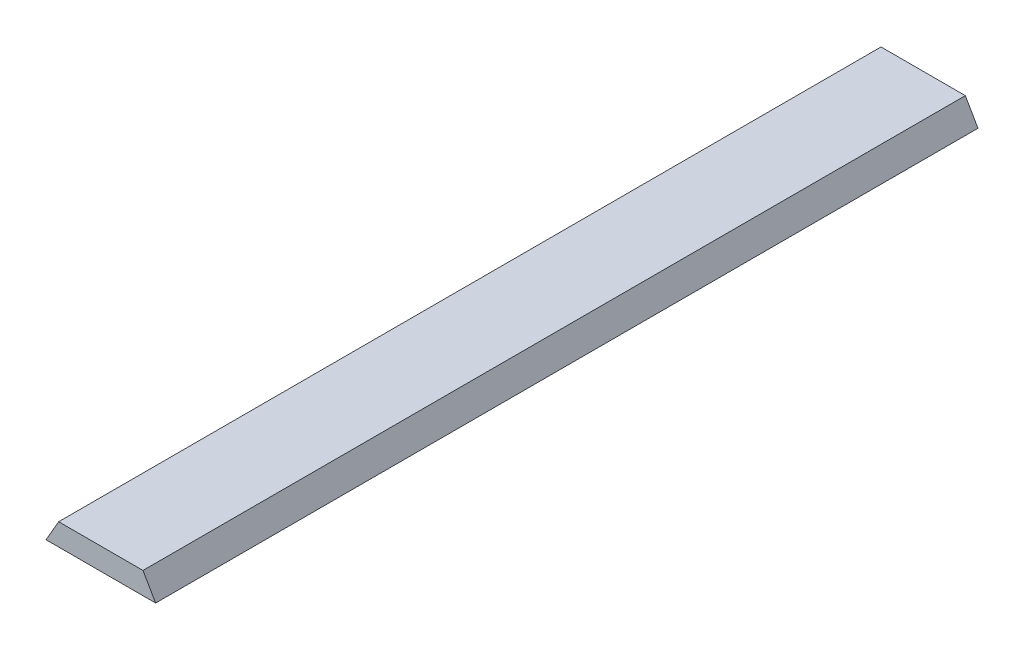
ISO-10303-21;
HEADER;
FILE_DESCRIPTION(('STEP AP214'),'2;1');
FILE_NAME('part.step','',(''),(''),'','','');
FILE_SCHEMA(('AUTOMOTIVE_DESIGN { 1 0 10303 214 1 1 1 1 }'));
ENDSEC;
DATA;
#1=APPLICATION_CONTEXT('core data for automotive mechanical design processes');
#2=APPLICATION_PROTOCOL_DEFINITION('international standard','automotive_design',2000,#1);
#3=PRODUCT_CONTEXT('',#1,'mechanical');
#4=PRODUCT('Part','Part','',(#3));
#5=PRODUCT_RELATED_PRODUCT_CATEGORY('part','',(#4));
#6=PRODUCT_DEFINITION_FORMATION('','',#4);
#7=PRODUCT_DEFINITION_CONTEXT('part definition',#1,'design');
#8=PRODUCT_DEFINITION('design','',#6,#7);
#9=PRODUCT_DEFINITION_SHAPE('','',#8);
#10=(LENGTH_UNIT() NAMED_UNIT(*) SI_UNIT(.MILLI.,.METRE.));
#11=(NAMED_UNIT(*) PLANE_ANGLE_UNIT() SI_UNIT($,.RADIAN.));
#12=(NAMED_UNIT(*) SI_UNIT($,.STERADIAN.) SOLID_ANGLE_UNIT());
#13=UNCERTAINTY_MEASURE_WITH_UNIT(LENGTH_MEASURE(1.E-05),#10,'distance_accuracy_value','');
#14=(GEOMETRIC_REPRESENTATION_CONTEXT(3) GLOBAL_UNCERTAINTY_ASSIGNED_CONTEXT((#13)) GLOBAL_UNIT_ASSIGNED_CONTEXT((#10,
#11,#12)) REPRESENTATION_CONTEXT('',''));
#15=CARTESIAN_POINT('',(0.,0.,0.));
#16=DIRECTION('',(0.,0.,1.));
#17=DIRECTION('',(1.,0.,0.));
#18=AXIS2_PLACEMENT_3D('',#15,#16,#17);
#19=CARTESIAN_POINT('',(-1.,0.2,15.));
#20=DIRECTION('',(0.,-1.,0.));
#21=DIRECTION('',(0.,0.,-1.));
#22=AXIS2_PLACEMENT_3D('',#19,#20,#21);
#23=PLANE('',#22);
#24=DIRECTION('',(-1.,0.,0.));
#25=VECTOR('',#24,1.);
#26=CARTESIAN_POINT('',(-1.,0.2,0.));
#27=LINE('',#26,#25);
#28=CARTESIAN_POINT('',(0.769059892324149,0.2,0.));
#29=VERTEX_POINT('',#28);
#30=CARTESIAN_POINT('',(-0.76905989232415,0.2,0.));
#31=VERTEX_POINT('',#30);
#32=EDGE_CURVE('E104',#29,#31,#27,.T.);
#33=ORIENTED_EDGE('',*,*,#32,.T.);
#34=DIRECTION('',(0.,0.,1.));
#35=VECTOR('',#34,1.);
#36=CARTESIAN_POINT('',(-0.76905989232415,0.2,15.));
#37=LINE('',#36,#35);
#38=CARTESIAN_POINT('',(-0.76905989232415,0.2,15.));
#39=VERTEX_POINT('',#38);
#40=EDGE_CURVE('E51',#31,#39,#37,.T.);
#41=ORIENTED_EDGE('',*,*,#40,.T.);
#42=DIRECTION('',(-1.,0.,0.));
#43=VECTOR('',#42,1.);
#44=CARTESIAN_POINT('',(-1.,0.2,15.));
#45=LINE('',#44,#43);
#46=CARTESIAN_POINT('',(0.769059892324149,0.2,15.));
#47=VERTEX_POINT('',#46);
#48=EDGE_CURVE('E78',#47,#39,#45,.T.);
#49=ORIENTED_EDGE('',*,*,#48,.F.);
#50=DIRECTION('',(0.,0.,-1.));
#51=VECTOR('',#50,1.);
#52=CARTESIAN_POINT('',(0.769059892324149,0.2,15.));
#53=LINE('',#52,#51);
#54=EDGE_CURVE('E99',#47,#29,#53,.T.);
#55=ORIENTED_EDGE('',*,*,#54,.T.);
#56=EDGE_LOOP('',(#33,#41,#49,#55));
#57=FACE_BOUND('',#56,.T.);
#58=ADVANCED_FACE('F35',(#57),#23,.F.);
#59=CARTESIAN_POINT('',(-1.,-0.2,15.));
#60=DIRECTION('',(0.,1.,0.));
#61=DIRECTION('',(0.,0.,1.));
#62=AXIS2_PLACEMENT_3D('',#59,#60,#61);
#63=PLANE('',#62);
#64=DIRECTION('',(1.,0.,0.));
#65=VECTOR('',#64,1.);
#66=CARTESIAN_POINT('',(-1.,-0.2,0.));
#67=LINE('',#66,#65);
#68=CARTESIAN_POINT('',(-1.,-0.2,0.));
#69=VERTEX_POINT('',#68);
#70=CARTESIAN_POINT('',(1.,-0.2,0.));
#71=VERTEX_POINT('',#70);
#72=EDGE_CURVE('E108',#69,#71,#67,.T.);
#73=ORIENTED_EDGE('',*,*,#72,.T.);
#74=DIRECTION('',(0.,0.,-1.));
#75=VECTOR('',#74,1.);
#76=CARTESIAN_POINT('',(1.,-0.2,15.));
#77=LINE('',#76,#75);
#78=CARTESIAN_POINT('',(1.,-0.2,15.));
#79=VERTEX_POINT('',#78);
#80=EDGE_CURVE('E88',#79,#71,#77,.T.);
#81=ORIENTED_EDGE('',*,*,#80,.F.);
#82=DIRECTION('',(1.,0.,0.));
#83=VECTOR('',#82,1.);
#84=CARTESIAN_POINT('',(-1.,-0.2,15.));
#85=LINE('',#84,#83);
#86=CARTESIAN_POINT('',(-1.,-0.2,15.));
#87=VERTEX_POINT('',#86);
#88=EDGE_CURVE('E76',#87,#79,#85,.T.);
#89=ORIENTED_EDGE('',*,*,#88,.F.);
#90=DIRECTION('',(0.,0.,-1.));
#91=VECTOR('',#90,1.);
#92=CARTESIAN_POINT('',(-1.,-0.2,15.));
#93=LINE('',#92,#91);
#94=EDGE_CURVE('E85',#87,#69,#93,.T.);
#95=ORIENTED_EDGE('',*,*,#94,.T.);
#96=EDGE_LOOP('',(#73,#81,#89,#95));
#97=FACE_BOUND('',#96,.T.);
#98=ADVANCED_FACE('F84',(#97),#63,.F.);
#99=CARTESIAN_POINT('',(0.,0.,15.));
#100=DIRECTION('',(0.,0.,-1.));
#101=DIRECTION('',(-1.,0.,0.));
#102=AXIS2_PLACEMENT_3D('',#99,#100,#101);
#103=PLANE('',#102);
#104=ORIENTED_EDGE('',*,*,#48,.T.);
#105=DIRECTION('',(0.500000000000001,0.866025403784438,0.));
#106=VECTOR('',#105,1.);
#107=CARTESIAN_POINT('',(-1.,-0.2,15.));
#108=LINE('',#107,#106);
#109=EDGE_CURVE('E11',#39,#87,#108,.F.);
#110=ORIENTED_EDGE('',*,*,#109,.T.);
#111=ORIENTED_EDGE('',*,*,#88,.T.);
#112=DIRECTION('',(0.500000000000001,-0.866025403784438,0.));
#113=VECTOR('',#112,1.);
#114=CARTESIAN_POINT('',(0.769059892324149,0.2,15.));
#115=LINE('',#114,#113);
#116=EDGE_CURVE('E44',#79,#47,#115,.F.);
#117=ORIENTED_EDGE('',*,*,#116,.T.);
#118=EDGE_LOOP('',(#104,#110,#111,#117));
#119=FACE_BOUND('',#118,.T.);
#120=ADVANCED_FACE('F75',(#119),#103,.F.);
#121=CARTESIAN_POINT('',(0.,0.,0.));
#122=DIRECTION('',(0.,0.,-1.));
#123=DIRECTION('',(-1.,0.,0.));
#124=AXIS2_PLACEMENT_3D('',#121,#122,#123);
#125=PLANE('',#124);
#126=ORIENTED_EDGE('',*,*,#72,.F.);
#127=DIRECTION('',(-0.500000000000001,-0.866025403784438,0.));
#128=VECTOR('',#127,1.);
#129=CARTESIAN_POINT('',(-0.663397459621556,0.38301270189222,0.));
#130=LINE('',#129,#128);
#131=EDGE_CURVE('E91',#69,#31,#130,.F.);
#132=ORIENTED_EDGE('',*,*,#131,.T.);
#133=ORIENTED_EDGE('',*,*,#32,.F.);
#134=DIRECTION('',(-0.500000000000001,0.866025403784438,0.));
#135=VECTOR('',#134,1.);
#136=CARTESIAN_POINT('',(0.663397459621555,0.383012701892219,0.));
#137=LINE('',#136,#135);
#138=EDGE_CURVE('E92',#29,#71,#137,.F.);
#139=ORIENTED_EDGE('',*,*,#138,.T.);
#140=EDGE_LOOP('',(#126,#132,#133,#139));
#141=FACE_BOUND('',#140,.T.);
#142=ADVANCED_FACE('F107',(#141),#125,.T.);
#143=CARTESIAN_POINT('',(-1.,-0.2,15.));
#144=DIRECTION('',(0.866025403784438,-0.500000000000001,0.));
#145=DIRECTION('',(0.,0.,-1.));
#146=AXIS2_PLACEMENT_3D('',#143,#144,#145);
#147=PLANE('',#146);
#148=ORIENTED_EDGE('',*,*,#109,.F.);
#149=ORIENTED_EDGE('',*,*,#40,.F.);
#150=ORIENTED_EDGE('',*,*,#131,.F.);
#151=ORIENTED_EDGE('',*,*,#94,.F.);
#152=EDGE_LOOP('',(#148,#149,#150,#151));
#153=FACE_BOUND('',#152,.T.);
#154=ADVANCED_FACE('F90',(#153),#147,.F.);
#155=CARTESIAN_POINT('',(0.769059892324149,0.2,15.));
#156=DIRECTION('',(-0.866025403784438,-0.500000000000001,0.));
#157=DIRECTION('',(0.,0.,-1.));
#158=AXIS2_PLACEMENT_3D('',#155,#156,#157);
#159=PLANE('',#158);
#160=ORIENTED_EDGE('',*,*,#116,.F.);
#161=ORIENTED_EDGE('',*,*,#80,.T.);
#162=ORIENTED_EDGE('',*,*,#138,.F.);
#163=ORIENTED_EDGE('',*,*,#54,.F.);
#164=EDGE_LOOP('',(#160,#161,#162,#163));
#165=FACE_BOUND('',#164,.T.);
#166=ADVANCED_FACE('F38',(#165),#159,.F.);
#167=CLOSED_SHELL('',(#58,#98,#120,#142,#154,#166));
#168=MANIFOLD_SOLID_BREP('B2',#167);
#169=ADVANCED_BREP_SHAPE_REPRESENTATION('',(#18,#168),#14);
#170=SHAPE_DEFINITION_REPRESENTATION(#9,#169);
ENDSEC;
END-ISO-10303-21;
